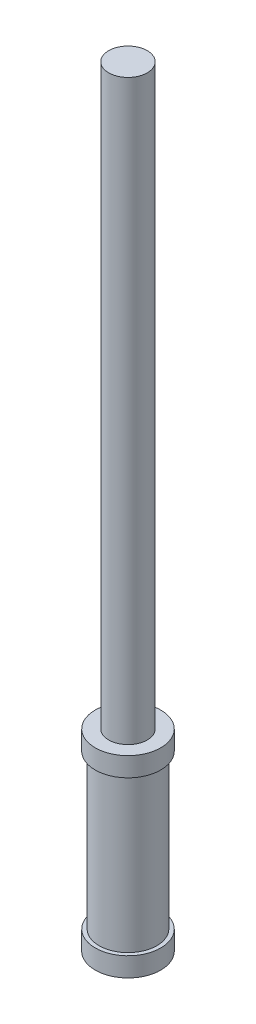
ISO-10303-21;
HEADER;
FILE_DESCRIPTION(('STEP AP214'),'2;1');
FILE_NAME('part.step','',(''),(''),'','','');
FILE_SCHEMA(('AUTOMOTIVE_DESIGN { 1 0 10303 214 1 1 1 1 }'));
ENDSEC;
DATA;
#1=APPLICATION_CONTEXT('core data for automotive mechanical design processes');
#2=APPLICATION_PROTOCOL_DEFINITION('international standard','automotive_design',2000,#1);
#3=PRODUCT_CONTEXT('',#1,'mechanical');
#4=PRODUCT('Part','Part','',(#3));
#5=PRODUCT_RELATED_PRODUCT_CATEGORY('part','',(#4));
#6=PRODUCT_DEFINITION_FORMATION('','',#4);
#7=PRODUCT_DEFINITION_CONTEXT('part definition',#1,'design');
#8=PRODUCT_DEFINITION('design','',#6,#7);
#9=PRODUCT_DEFINITION_SHAPE('','',#8);
#10=(LENGTH_UNIT() NAMED_UNIT(*) SI_UNIT(.MILLI.,.METRE.));
#11=(NAMED_UNIT(*) PLANE_ANGLE_UNIT() SI_UNIT($,.RADIAN.));
#12=(NAMED_UNIT(*) SI_UNIT($,.STERADIAN.) SOLID_ANGLE_UNIT());
#13=UNCERTAINTY_MEASURE_WITH_UNIT(LENGTH_MEASURE(1.E-05),#10,'distance_accuracy_value','');
#14=(GEOMETRIC_REPRESENTATION_CONTEXT(3) GLOBAL_UNCERTAINTY_ASSIGNED_CONTEXT((#13)) GLOBAL_UNIT_ASSIGNED_CONTEXT((#10,
#11,#12)) REPRESENTATION_CONTEXT('',''));
#15=CARTESIAN_POINT('',(0.,0.,0.));
#16=DIRECTION('',(0.,0.,1.));
#17=DIRECTION('',(1.,0.,0.));
#18=AXIS2_PLACEMENT_3D('',#15,#16,#17);
#19=CARTESIAN_POINT('',(0.,50.,0.));
#20=DIRECTION('',(0.,-1.,0.));
#21=DIRECTION('',(0.,0.,-1.));
#22=AXIS2_PLACEMENT_3D('',#19,#20,#21);
#23=CYLINDRICAL_SURFACE('',#22,8.5);
#24=CARTESIAN_POINT('',(0.,45.,0.));
#25=DIRECTION('',(0.,1.,0.));
#26=DIRECTION('',(0.,0.,1.));
#27=AXIS2_PLACEMENT_3D('',#24,#25,#26);
#28=CIRCLE('',#27,8.5);
#29=CARTESIAN_POINT('',(0.,45.,8.5));
#30=VERTEX_POINT('',#29);
#31=EDGE_CURVE('E59',#30,#30,#28,.T.);
#32=ORIENTED_EDGE('',*,*,#31,.T.);
#33=EDGE_LOOP('',(#32));
#34=FACE_BOUND('',#33,.T.);
#35=CARTESIAN_POINT('',(0.,50.,0.));
#36=DIRECTION('',(0.,1.,0.));
#37=DIRECTION('',(0.,0.,1.));
#38=AXIS2_PLACEMENT_3D('',#35,#36,#37);
#39=CIRCLE('',#38,8.5);
#40=CARTESIAN_POINT('',(0.,50.,8.5));
#41=VERTEX_POINT('',#40);
#42=EDGE_CURVE('E49',#41,#41,#39,.T.);
#43=ORIENTED_EDGE('',*,*,#42,.F.);
#44=EDGE_LOOP('',(#43));
#45=FACE_BOUND('',#44,.T.);
#46=ADVANCED_FACE('F42',(#34,#45),#23,.T.);
#47=CARTESIAN_POINT('',(0.,50.,0.));
#48=DIRECTION('',(0.,1.,0.));
#49=DIRECTION('',(0.,0.,1.));
#50=AXIS2_PLACEMENT_3D('',#47,#48,#49);
#51=PLANE('',#50);
#52=CARTESIAN_POINT('',(0.,50.,0.));
#53=DIRECTION('',(0.,1.,0.));
#54=DIRECTION('',(0.,0.,1.));
#55=AXIS2_PLACEMENT_3D('',#52,#53,#54);
#56=CIRCLE('',#55,5.);
#57=CARTESIAN_POINT('',(0.,50.,5.));
#58=VERTEX_POINT('',#57);
#59=EDGE_CURVE('E12',#58,#58,#56,.T.);
#60=ORIENTED_EDGE('',*,*,#59,.F.);
#61=EDGE_LOOP('',(#60));
#62=FACE_BOUND('',#61,.T.);
#63=ORIENTED_EDGE('',*,*,#42,.T.);
#64=EDGE_LOOP('',(#63));
#65=FACE_BOUND('',#64,.T.);
#66=ADVANCED_FACE('F93',(#62,#65),#51,.T.);
#67=CARTESIAN_POINT('',(0.,200.,0.));
#68=DIRECTION('',(0.,-1.,0.));
#69=DIRECTION('',(0.,0.,-1.));
#70=AXIS2_PLACEMENT_3D('',#67,#68,#69);
#71=CYLINDRICAL_SURFACE('',#70,5.);
#72=CARTESIAN_POINT('',(0.,200.,0.));
#73=DIRECTION('',(0.,1.,0.));
#74=DIRECTION('',(0.,0.,1.));
#75=AXIS2_PLACEMENT_3D('',#72,#73,#74);
#76=CIRCLE('',#75,5.);
#77=CARTESIAN_POINT('',(0.,200.,5.));
#78=VERTEX_POINT('',#77);
#79=EDGE_CURVE('E55',#78,#78,#76,.T.);
#80=ORIENTED_EDGE('',*,*,#79,.F.);
#81=EDGE_LOOP('',(#80));
#82=FACE_BOUND('',#81,.T.);
#83=ORIENTED_EDGE('',*,*,#59,.T.);
#84=EDGE_LOOP('',(#83));
#85=FACE_BOUND('',#84,.T.);
#86=ADVANCED_FACE('F100',(#82,#85),#71,.T.);
#87=CARTESIAN_POINT('',(0.,200.,0.));
#88=DIRECTION('',(0.,1.,0.));
#89=DIRECTION('',(0.,0.,1.));
#90=AXIS2_PLACEMENT_3D('',#87,#88,#89);
#91=PLANE('',#90);
#92=ORIENTED_EDGE('',*,*,#79,.T.);
#93=EDGE_LOOP('',(#92));
#94=FACE_BOUND('',#93,.T.);
#95=ADVANCED_FACE('F78',(#94),#91,.T.);
#96=CARTESIAN_POINT('',(0.,5.,0.));
#97=DIRECTION('',(0.,1.,0.));
#98=DIRECTION('',(0.,0.,1.));
#99=AXIS2_PLACEMENT_3D('',#96,#97,#98);
#100=PLANE('',#99);
#101=CARTESIAN_POINT('',(0.,5.,0.));
#102=DIRECTION('',(0.,1.,0.));
#103=DIRECTION('',(0.,0.,1.));
#104=AXIS2_PLACEMENT_3D('',#101,#102,#103);
#105=CIRCLE('',#104,7.5);
#106=CARTESIAN_POINT('',(0.,5.,7.5));
#107=VERTEX_POINT('',#106);
#108=EDGE_CURVE('E62',#107,#107,#105,.T.);
#109=ORIENTED_EDGE('',*,*,#108,.F.);
#110=EDGE_LOOP('',(#109));
#111=FACE_BOUND('',#110,.T.);
#112=CARTESIAN_POINT('',(0.,5.,0.));
#113=DIRECTION('',(0.,1.,0.));
#114=DIRECTION('',(0.,0.,1.));
#115=AXIS2_PLACEMENT_3D('',#112,#113,#114);
#116=CIRCLE('',#115,8.5);
#117=CARTESIAN_POINT('',(0.,5.,8.5));
#118=VERTEX_POINT('',#117);
#119=EDGE_CURVE('E58',#118,#118,#116,.T.);
#120=ORIENTED_EDGE('',*,*,#119,.T.);
#121=EDGE_LOOP('',(#120));
#122=FACE_BOUND('',#121,.T.);
#123=ADVANCED_FACE('F74',(#111,#122),#100,.T.);
#124=CARTESIAN_POINT('',(0.,45.,0.));
#125=DIRECTION('',(0.,1.,0.));
#126=DIRECTION('',(0.,0.,1.));
#127=AXIS2_PLACEMENT_3D('',#124,#125,#126);
#128=PLANE('',#127);
#129=CARTESIAN_POINT('',(0.,45.,0.));
#130=DIRECTION('',(0.,1.,0.));
#131=DIRECTION('',(0.,0.,1.));
#132=AXIS2_PLACEMENT_3D('',#129,#130,#131);
#133=CIRCLE('',#132,7.5);
#134=CARTESIAN_POINT('',(0.,45.,7.5));
#135=VERTEX_POINT('',#134);
#136=EDGE_CURVE('E65',#135,#135,#133,.T.);
#137=ORIENTED_EDGE('',*,*,#136,.T.);
#138=EDGE_LOOP('',(#137));
#139=FACE_BOUND('',#138,.T.);
#140=ORIENTED_EDGE('',*,*,#31,.F.);
#141=EDGE_LOOP('',(#140));
#142=FACE_BOUND('',#141,.T.);
#143=ADVANCED_FACE('F77',(#139,#142),#128,.F.);
#144=CARTESIAN_POINT('',(0.,5.,0.));
#145=DIRECTION('',(0.,1.,0.));
#146=DIRECTION('',(0.,0.,1.));
#147=AXIS2_PLACEMENT_3D('',#144,#145,#146);
#148=CYLINDRICAL_SURFACE('',#147,7.5);
#149=ORIENTED_EDGE('',*,*,#108,.T.);
#150=EDGE_LOOP('',(#149));
#151=FACE_BOUND('',#150,.T.);
#152=ORIENTED_EDGE('',*,*,#136,.F.);
#153=EDGE_LOOP('',(#152));
#154=FACE_BOUND('',#153,.T.);
#155=ADVANCED_FACE('F71',(#151,#154),#148,.T.);
#156=CARTESIAN_POINT('',(0.,0.,0.));
#157=DIRECTION('',(0.,1.,0.));
#158=DIRECTION('',(0.,0.,1.));
#159=AXIS2_PLACEMENT_3D('',#156,#157,#158);
#160=PLANE('',#159);
#161=CARTESIAN_POINT('',(0.,0.,0.));
#162=DIRECTION('',(0.,1.,0.));
#163=DIRECTION('',(0.,0.,1.));
#164=AXIS2_PLACEMENT_3D('',#161,#162,#163);
#165=CIRCLE('',#164,8.5);
#166=CARTESIAN_POINT('',(0.,0.,8.5));
#167=VERTEX_POINT('',#166);
#168=EDGE_CURVE('E45',#167,#167,#165,.T.);
#169=ORIENTED_EDGE('',*,*,#168,.F.);
#170=EDGE_LOOP('',(#169));
#171=FACE_BOUND('',#170,.T.);
#172=ADVANCED_FACE('F84',(#171),#160,.F.);
#173=ORIENTED_EDGE('',*,*,#168,.T.);
#174=EDGE_LOOP('',(#173));
#175=FACE_BOUND('',#174,.T.);
#176=ORIENTED_EDGE('',*,*,#119,.F.);
#177=EDGE_LOOP('',(#176));
#178=FACE_BOUND('',#177,.T.);
#179=ADVANCED_FACE('F82',(#175,#178),#23,.T.);
#180=CLOSED_SHELL('',(#46,#66,#86,#95,#123,#143,#155,#172,#179));
#181=MANIFOLD_SOLID_BREP('B2',#180);
#182=ADVANCED_BREP_SHAPE_REPRESENTATION('',(#18,#181),#14);
#183=SHAPE_DEFINITION_REPRESENTATION(#9,#182);
ENDSEC;
END-ISO-10303-21;
